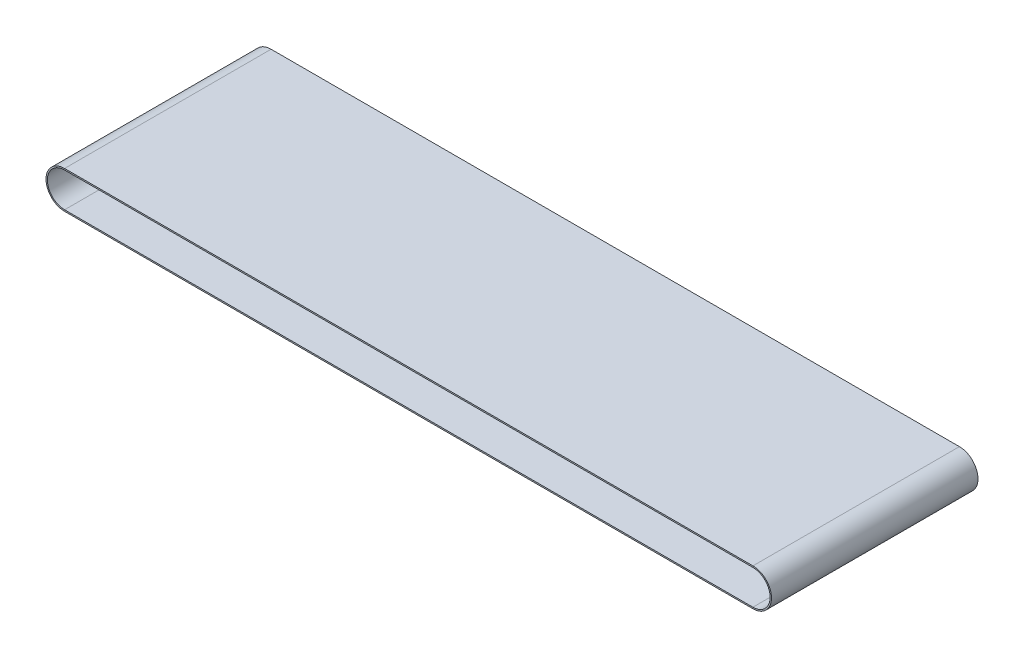
ISO-10303-21;
HEADER;
FILE_DESCRIPTION(('STEP AP214'),'2;1');
FILE_NAME('part.step','',(''),(''),'','','');
FILE_SCHEMA(('AUTOMOTIVE_DESIGN { 1 0 10303 214 1 1 1 1 }'));
ENDSEC;
DATA;
#1=APPLICATION_CONTEXT('core data for automotive mechanical design processes');
#2=APPLICATION_PROTOCOL_DEFINITION('international standard','automotive_design',2000,#1);
#3=PRODUCT_CONTEXT('',#1,'mechanical');
#4=PRODUCT('Part','Part','',(#3));
#5=PRODUCT_RELATED_PRODUCT_CATEGORY('part','',(#4));
#6=PRODUCT_DEFINITION_FORMATION('','',#4);
#7=PRODUCT_DEFINITION_CONTEXT('part definition',#1,'design');
#8=PRODUCT_DEFINITION('design','',#6,#7);
#9=PRODUCT_DEFINITION_SHAPE('','',#8);
#10=(LENGTH_UNIT() NAMED_UNIT(*) SI_UNIT(.MILLI.,.METRE.));
#11=(NAMED_UNIT(*) PLANE_ANGLE_UNIT() SI_UNIT($,.RADIAN.));
#12=(NAMED_UNIT(*) SI_UNIT($,.STERADIAN.) SOLID_ANGLE_UNIT());
#13=UNCERTAINTY_MEASURE_WITH_UNIT(LENGTH_MEASURE(1.E-05),#10,'distance_accuracy_value','');
#14=(GEOMETRIC_REPRESENTATION_CONTEXT(3) GLOBAL_UNCERTAINTY_ASSIGNED_CONTEXT((#13)) GLOBAL_UNIT_ASSIGNED_CONTEXT((#10,
#11,#12)) REPRESENTATION_CONTEXT('',''));
#15=CARTESIAN_POINT('',(0.,0.,0.));
#16=DIRECTION('',(0.,0.,1.));
#17=DIRECTION('',(1.,0.,0.));
#18=AXIS2_PLACEMENT_3D('',#15,#16,#17);
#19=CARTESIAN_POINT('',(-500.,0.,-150.));
#20=DIRECTION('',(0.,0.,1.));
#21=DIRECTION('',(1.,0.,0.));
#22=AXIS2_PLACEMENT_3D('',#19,#20,#21);
#23=CYLINDRICAL_SURFACE('',#22,27.);
#24=DIRECTION('',(0.,0.,1.));
#25=VECTOR('',#24,1.);
#26=CARTESIAN_POINT('',(-500.,-27.,-150.));
#27=LINE('',#26,#25);
#28=CARTESIAN_POINT('',(-500.,-27.,-150.));
#29=VERTEX_POINT('',#28);
#30=CARTESIAN_POINT('',(-500.,-27.,150.));
#31=VERTEX_POINT('',#30);
#32=EDGE_CURVE('E34',#29,#31,#27,.T.);
#33=ORIENTED_EDGE('',*,*,#32,.T.);
#34=CARTESIAN_POINT('',(-500.,0.,150.));
#35=DIRECTION('',(0.,0.,1.));
#36=DIRECTION('',(1.,0.,0.));
#37=AXIS2_PLACEMENT_3D('',#34,#35,#36);
#38=CIRCLE('',#37,27.);
#39=CARTESIAN_POINT('',(-500.,27.,150.));
#40=VERTEX_POINT('',#39);
#41=EDGE_CURVE('E126',#40,#31,#38,.T.);
#42=ORIENTED_EDGE('',*,*,#41,.F.);
#43=DIRECTION('',(0.,0.,1.));
#44=VECTOR('',#43,1.);
#45=CARTESIAN_POINT('',(-500.,27.,-150.));
#46=LINE('',#45,#44);
#47=CARTESIAN_POINT('',(-500.,27.,-150.));
#48=VERTEX_POINT('',#47);
#49=EDGE_CURVE('E11',#48,#40,#46,.T.);
#50=ORIENTED_EDGE('',*,*,#49,.F.);
#51=CARTESIAN_POINT('',(-500.,0.,-150.));
#52=DIRECTION('',(0.,0.,1.));
#53=DIRECTION('',(1.,0.,0.));
#54=AXIS2_PLACEMENT_3D('',#51,#52,#53);
#55=CIRCLE('',#54,27.);
#56=EDGE_CURVE('E145',#48,#29,#55,.T.);
#57=ORIENTED_EDGE('',*,*,#56,.T.);
#58=EDGE_LOOP('',(#33,#42,#50,#57));
#59=FACE_BOUND('',#58,.T.);
#60=ADVANCED_FACE('F31',(#59),#23,.T.);
#61=CARTESIAN_POINT('',(-500.,27.,-150.));
#62=DIRECTION('',(0.,1.,0.));
#63=DIRECTION('',(0.,0.,1.));
#64=AXIS2_PLACEMENT_3D('',#61,#62,#63);
#65=PLANE('',#64);
#66=ORIENTED_EDGE('',*,*,#49,.T.);
#67=DIRECTION('',(-1.,0.,0.));
#68=VECTOR('',#67,1.);
#69=CARTESIAN_POINT('',(-500.,27.,150.));
#70=LINE('',#69,#68);
#71=CARTESIAN_POINT('',(500.,27.,150.));
#72=VERTEX_POINT('',#71);
#73=EDGE_CURVE('E135',#72,#40,#70,.T.);
#74=ORIENTED_EDGE('',*,*,#73,.F.);
#75=DIRECTION('',(0.,0.,1.));
#76=VECTOR('',#75,1.);
#77=CARTESIAN_POINT('',(500.,27.,-150.));
#78=LINE('',#77,#76);
#79=CARTESIAN_POINT('',(500.,27.,-150.));
#80=VERTEX_POINT('',#79);
#81=EDGE_CURVE('E39',#80,#72,#78,.T.);
#82=ORIENTED_EDGE('',*,*,#81,.F.);
#83=DIRECTION('',(-1.,0.,0.));
#84=VECTOR('',#83,1.);
#85=CARTESIAN_POINT('',(-500.,27.,-150.));
#86=LINE('',#85,#84);
#87=EDGE_CURVE('E156',#80,#48,#86,.T.);
#88=ORIENTED_EDGE('',*,*,#87,.T.);
#89=EDGE_LOOP('',(#66,#74,#82,#88));
#90=FACE_BOUND('',#89,.T.);
#91=ADVANCED_FACE('F168',(#90),#65,.T.);
#92=CARTESIAN_POINT('',(500.,0.,-150.));
#93=DIRECTION('',(0.,0.,1.));
#94=DIRECTION('',(1.,0.,0.));
#95=AXIS2_PLACEMENT_3D('',#92,#93,#94);
#96=CYLINDRICAL_SURFACE('',#95,27.);
#97=ORIENTED_EDGE('',*,*,#81,.T.);
#98=CARTESIAN_POINT('',(500.,0.,150.));
#99=DIRECTION('',(0.,0.,1.));
#100=DIRECTION('',(1.,0.,0.));
#101=AXIS2_PLACEMENT_3D('',#98,#99,#100);
#102=CIRCLE('',#101,27.);
#103=CARTESIAN_POINT('',(500.,-27.,150.));
#104=VERTEX_POINT('',#103);
#105=EDGE_CURVE('E132',#104,#72,#102,.T.);
#106=ORIENTED_EDGE('',*,*,#105,.F.);
#107=DIRECTION('',(0.,0.,1.));
#108=VECTOR('',#107,1.);
#109=CARTESIAN_POINT('',(500.,-27.,-150.));
#110=LINE('',#109,#108);
#111=CARTESIAN_POINT('',(500.,-27.,-150.));
#112=VERTEX_POINT('',#111);
#113=EDGE_CURVE('E159',#112,#104,#110,.T.);
#114=ORIENTED_EDGE('',*,*,#113,.F.);
#115=CARTESIAN_POINT('',(500.,0.,-150.));
#116=DIRECTION('',(0.,0.,1.));
#117=DIRECTION('',(1.,0.,0.));
#118=AXIS2_PLACEMENT_3D('',#115,#116,#117);
#119=CIRCLE('',#118,27.);
#120=EDGE_CURVE('E153',#112,#80,#119,.T.);
#121=ORIENTED_EDGE('',*,*,#120,.T.);
#122=EDGE_LOOP('',(#97,#106,#114,#121));
#123=FACE_BOUND('',#122,.T.);
#124=ADVANCED_FACE('F174',(#123),#96,.T.);
#125=CARTESIAN_POINT('',(-500.,-27.,-150.));
#126=DIRECTION('',(0.,-1.,0.));
#127=DIRECTION('',(0.,0.,-1.));
#128=AXIS2_PLACEMENT_3D('',#125,#126,#127);
#129=PLANE('',#128);
#130=ORIENTED_EDGE('',*,*,#113,.T.);
#131=DIRECTION('',(1.,0.,0.));
#132=VECTOR('',#131,1.);
#133=CARTESIAN_POINT('',(-500.,-27.,150.));
#134=LINE('',#133,#132);
#135=EDGE_CURVE('E129',#31,#104,#134,.T.);
#136=ORIENTED_EDGE('',*,*,#135,.F.);
#137=ORIENTED_EDGE('',*,*,#32,.F.);
#138=DIRECTION('',(1.,0.,0.));
#139=VECTOR('',#138,1.);
#140=CARTESIAN_POINT('',(-500.,-27.,-150.));
#141=LINE('',#140,#139);
#142=EDGE_CURVE('E150',#29,#112,#141,.T.);
#143=ORIENTED_EDGE('',*,*,#142,.T.);
#144=EDGE_LOOP('',(#130,#136,#137,#143));
#145=FACE_BOUND('',#144,.T.);
#146=ADVANCED_FACE('F163',(#145),#129,.T.);
#147=CARTESIAN_POINT('',(-500.,0.,-150.));
#148=DIRECTION('',(0.,0.,1.));
#149=DIRECTION('',(1.,0.,0.));
#150=AXIS2_PLACEMENT_3D('',#147,#148,#149);
#151=PLANE('',#150);
#152=DIRECTION('',(1.,0.,0.));
#153=VECTOR('',#152,1.);
#154=CARTESIAN_POINT('',(-500.,-25.,-150.));
#155=LINE('',#154,#153);
#156=CARTESIAN_POINT('',(-500.,-25.,-150.));
#157=VERTEX_POINT('',#156);
#158=CARTESIAN_POINT('',(500.,-25.,-150.));
#159=VERTEX_POINT('',#158);
#160=EDGE_CURVE('E108',#157,#159,#155,.T.);
#161=ORIENTED_EDGE('',*,*,#160,.T.);
#162=CARTESIAN_POINT('',(500.,0.,-150.));
#163=DIRECTION('',(0.,0.,1.));
#164=DIRECTION('',(1.,0.,0.));
#165=AXIS2_PLACEMENT_3D('',#162,#163,#164);
#166=CIRCLE('',#165,25.);
#167=CARTESIAN_POINT('',(500.,25.,-150.));
#168=VERTEX_POINT('',#167);
#169=EDGE_CURVE('E138',#159,#168,#166,.T.);
#170=ORIENTED_EDGE('',*,*,#169,.T.);
#171=DIRECTION('',(-1.,0.,0.));
#172=VECTOR('',#171,1.);
#173=CARTESIAN_POINT('',(-500.,25.,-150.));
#174=LINE('',#173,#172);
#175=CARTESIAN_POINT('',(-500.,25.,-150.));
#176=VERTEX_POINT('',#175);
#177=EDGE_CURVE('E103',#168,#176,#174,.T.);
#178=ORIENTED_EDGE('',*,*,#177,.T.);
#179=CARTESIAN_POINT('',(-500.,0.,-150.));
#180=DIRECTION('',(0.,0.,1.));
#181=DIRECTION('',(1.,0.,0.));
#182=AXIS2_PLACEMENT_3D('',#179,#180,#181);
#183=CIRCLE('',#182,25.);
#184=EDGE_CURVE('E47',#176,#157,#183,.T.);
#185=ORIENTED_EDGE('',*,*,#184,.T.);
#186=EDGE_LOOP('',(#161,#170,#178,#185));
#187=FACE_BOUND('',#186,.T.);
#188=ORIENTED_EDGE('',*,*,#56,.F.);
#189=ORIENTED_EDGE('',*,*,#87,.F.);
#190=ORIENTED_EDGE('',*,*,#120,.F.);
#191=ORIENTED_EDGE('',*,*,#142,.F.);
#192=EDGE_LOOP('',(#188,#189,#190,#191));
#193=FACE_BOUND('',#192,.T.);
#194=ADVANCED_FACE('F172',(#187,#193),#151,.F.);
#195=CARTESIAN_POINT('',(500.,0.,-150.));
#196=DIRECTION('',(0.,0.,1.));
#197=DIRECTION('',(1.,0.,0.));
#198=AXIS2_PLACEMENT_3D('',#195,#196,#197);
#199=CYLINDRICAL_SURFACE('',#198,25.);
#200=DIRECTION('',(0.,0.,1.));
#201=VECTOR('',#200,1.);
#202=CARTESIAN_POINT('',(500.,-25.,-150.));
#203=LINE('',#202,#201);
#204=CARTESIAN_POINT('',(500.,-25.,150.));
#205=VERTEX_POINT('',#204);
#206=EDGE_CURVE('E113',#159,#205,#203,.T.);
#207=ORIENTED_EDGE('',*,*,#206,.T.);
#208=CARTESIAN_POINT('',(500.,0.,150.));
#209=DIRECTION('',(0.,0.,1.));
#210=DIRECTION('',(1.,0.,0.));
#211=AXIS2_PLACEMENT_3D('',#208,#209,#210);
#212=CIRCLE('',#211,25.);
#213=CARTESIAN_POINT('',(500.,25.,150.));
#214=VERTEX_POINT('',#213);
#215=EDGE_CURVE('E111',#205,#214,#212,.T.);
#216=ORIENTED_EDGE('',*,*,#215,.T.);
#217=DIRECTION('',(0.,0.,1.));
#218=VECTOR('',#217,1.);
#219=CARTESIAN_POINT('',(500.,25.,-150.));
#220=LINE('',#219,#218);
#221=EDGE_CURVE('E96',#168,#214,#220,.T.);
#222=ORIENTED_EDGE('',*,*,#221,.F.);
#223=ORIENTED_EDGE('',*,*,#169,.F.);
#224=EDGE_LOOP('',(#207,#216,#222,#223));
#225=FACE_BOUND('',#224,.T.);
#226=ADVANCED_FACE('F112',(#225),#199,.F.);
#227=CARTESIAN_POINT('',(-500.,-25.,-150.));
#228=DIRECTION('',(0.,-1.,0.));
#229=DIRECTION('',(0.,0.,-1.));
#230=AXIS2_PLACEMENT_3D('',#227,#228,#229);
#231=PLANE('',#230);
#232=DIRECTION('',(0.,0.,1.));
#233=VECTOR('',#232,1.);
#234=CARTESIAN_POINT('',(-500.,-25.,-150.));
#235=LINE('',#234,#233);
#236=CARTESIAN_POINT('',(-500.,-25.,150.));
#237=VERTEX_POINT('',#236);
#238=EDGE_CURVE('E146',#157,#237,#235,.T.);
#239=ORIENTED_EDGE('',*,*,#238,.T.);
#240=DIRECTION('',(1.,0.,0.));
#241=VECTOR('',#240,1.);
#242=CARTESIAN_POINT('',(-500.,-25.,150.));
#243=LINE('',#242,#241);
#244=EDGE_CURVE('E122',#237,#205,#243,.T.);
#245=ORIENTED_EDGE('',*,*,#244,.T.);
#246=ORIENTED_EDGE('',*,*,#206,.F.);
#247=ORIENTED_EDGE('',*,*,#160,.F.);
#248=EDGE_LOOP('',(#239,#245,#246,#247));
#249=FACE_BOUND('',#248,.T.);
#250=ADVANCED_FACE('F217',(#249),#231,.F.);
#251=CARTESIAN_POINT('',(-500.,0.,-150.));
#252=DIRECTION('',(0.,0.,1.));
#253=DIRECTION('',(1.,0.,0.));
#254=AXIS2_PLACEMENT_3D('',#251,#252,#253);
#255=CYLINDRICAL_SURFACE('',#254,25.);
#256=DIRECTION('',(0.,0.,1.));
#257=VECTOR('',#256,1.);
#258=CARTESIAN_POINT('',(-500.,25.,-150.));
#259=LINE('',#258,#257);
#260=CARTESIAN_POINT('',(-500.,25.,150.));
#261=VERTEX_POINT('',#260);
#262=EDGE_CURVE('E107',#176,#261,#259,.T.);
#263=ORIENTED_EDGE('',*,*,#262,.T.);
#264=CARTESIAN_POINT('',(-500.,0.,150.));
#265=DIRECTION('',(0.,0.,1.));
#266=DIRECTION('',(1.,0.,0.));
#267=AXIS2_PLACEMENT_3D('',#264,#265,#266);
#268=CIRCLE('',#267,25.);
#269=EDGE_CURVE('E120',#261,#237,#268,.T.);
#270=ORIENTED_EDGE('',*,*,#269,.T.);
#271=ORIENTED_EDGE('',*,*,#238,.F.);
#272=ORIENTED_EDGE('',*,*,#184,.F.);
#273=EDGE_LOOP('',(#263,#270,#271,#272));
#274=FACE_BOUND('',#273,.T.);
#275=ADVANCED_FACE('F226',(#274),#255,.F.);
#276=CARTESIAN_POINT('',(-500.,25.,-150.));
#277=DIRECTION('',(0.,1.,0.));
#278=DIRECTION('',(0.,0.,1.));
#279=AXIS2_PLACEMENT_3D('',#276,#277,#278);
#280=PLANE('',#279);
#281=ORIENTED_EDGE('',*,*,#221,.T.);
#282=DIRECTION('',(-1.,0.,0.));
#283=VECTOR('',#282,1.);
#284=CARTESIAN_POINT('',(-500.,25.,150.));
#285=LINE('',#284,#283);
#286=EDGE_CURVE('E100',#214,#261,#285,.T.);
#287=ORIENTED_EDGE('',*,*,#286,.T.);
#288=ORIENTED_EDGE('',*,*,#262,.F.);
#289=ORIENTED_EDGE('',*,*,#177,.F.);
#290=EDGE_LOOP('',(#281,#287,#288,#289));
#291=FACE_BOUND('',#290,.T.);
#292=ADVANCED_FACE('F98',(#291),#280,.F.);
#293=CARTESIAN_POINT('',(-500.,0.,150.));
#294=DIRECTION('',(0.,0.,1.));
#295=DIRECTION('',(1.,0.,0.));
#296=AXIS2_PLACEMENT_3D('',#293,#294,#295);
#297=PLANE('',#296);
#298=ORIENTED_EDGE('',*,*,#41,.T.);
#299=ORIENTED_EDGE('',*,*,#135,.T.);
#300=ORIENTED_EDGE('',*,*,#105,.T.);
#301=ORIENTED_EDGE('',*,*,#73,.T.);
#302=EDGE_LOOP('',(#298,#299,#300,#301));
#303=FACE_BOUND('',#302,.T.);
#304=ORIENTED_EDGE('',*,*,#286,.F.);
#305=ORIENTED_EDGE('',*,*,#215,.F.);
#306=ORIENTED_EDGE('',*,*,#244,.F.);
#307=ORIENTED_EDGE('',*,*,#269,.F.);
#308=EDGE_LOOP('',(#304,#305,#306,#307));
#309=FACE_BOUND('',#308,.T.);
#310=ADVANCED_FACE('F118',(#303,#309),#297,.T.);
#311=CLOSED_SHELL('',(#60,#91,#124,#146,#194,#226,#250,#275,#292,#310));
#312=MANIFOLD_SOLID_BREP('B2',#311);
#313=ADVANCED_BREP_SHAPE_REPRESENTATION('',(#18,#312),#14);
#314=SHAPE_DEFINITION_REPRESENTATION(#9,#313);
ENDSEC;
END-ISO-10303-21;
